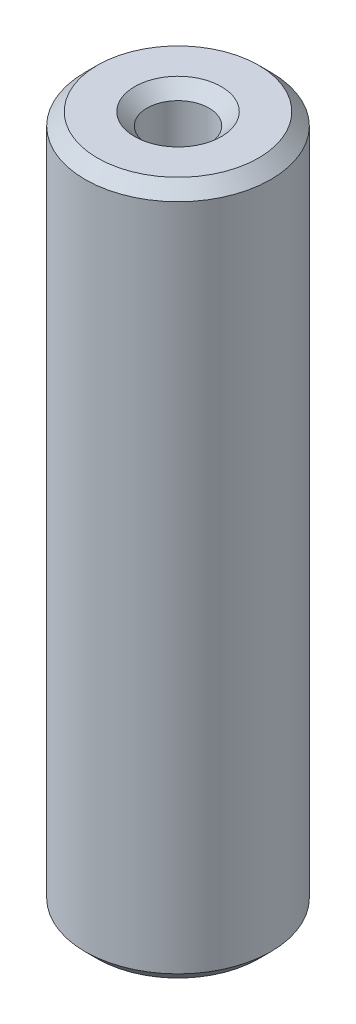
ISO-10303-21;
HEADER;
FILE_DESCRIPTION(('STEP AP214'),'2;1');
FILE_NAME('part.step','',(''),(''),'','','');
FILE_SCHEMA(('AUTOMOTIVE_DESIGN { 1 0 10303 214 1 1 1 1 }'));
ENDSEC;
DATA;
#1=APPLICATION_CONTEXT('core data for automotive mechanical design processes');
#2=APPLICATION_PROTOCOL_DEFINITION('international standard','automotive_design',2000,#1);
#3=PRODUCT_CONTEXT('',#1,'mechanical');
#4=PRODUCT('Part','Part','',(#3));
#5=PRODUCT_RELATED_PRODUCT_CATEGORY('part','',(#4));
#6=PRODUCT_DEFINITION_FORMATION('','',#4);
#7=PRODUCT_DEFINITION_CONTEXT('part definition',#1,'design');
#8=PRODUCT_DEFINITION('design','',#6,#7);
#9=PRODUCT_DEFINITION_SHAPE('','',#8);
#10=(LENGTH_UNIT() NAMED_UNIT(*) SI_UNIT(.MILLI.,.METRE.));
#11=(NAMED_UNIT(*) PLANE_ANGLE_UNIT() SI_UNIT($,.RADIAN.));
#12=(NAMED_UNIT(*) SI_UNIT($,.STERADIAN.) SOLID_ANGLE_UNIT());
#13=UNCERTAINTY_MEASURE_WITH_UNIT(LENGTH_MEASURE(1.E-05),#10,'distance_accuracy_value','');
#14=(GEOMETRIC_REPRESENTATION_CONTEXT(3) GLOBAL_UNCERTAINTY_ASSIGNED_CONTEXT((#13)) GLOBAL_UNIT_ASSIGNED_CONTEXT((#10,
#11,#12)) REPRESENTATION_CONTEXT('',''));
#15=CARTESIAN_POINT('',(0.,0.,0.));
#16=DIRECTION('',(0.,0.,1.));
#17=DIRECTION('',(1.,0.,0.));
#18=AXIS2_PLACEMENT_3D('',#15,#16,#17);
#19=CARTESIAN_POINT('',(0.,56.,0.));
#20=DIRECTION('',(0.,1.,0.));
#21=DIRECTION('',(0.,0.,1.));
#22=AXIS2_PLACEMENT_3D('',#19,#20,#21);
#23=PLANE('',#22);
#24=CARTESIAN_POINT('',(0.,56.,0.));
#25=DIRECTION('',(0.,1.,0.));
#26=DIRECTION('',(0.,0.,1.));
#27=AXIS2_PLACEMENT_3D('',#24,#25,#26);
#28=CIRCLE('',#27,3.5);
#29=CARTESIAN_POINT('',(0.,56.,3.5));
#30=VERTEX_POINT('',#29);
#31=EDGE_CURVE('E10',#30,#30,#28,.F.);
#32=ORIENTED_EDGE('',*,*,#31,.T.);
#33=EDGE_LOOP('',(#32));
#34=FACE_BOUND('',#33,.T.);
#35=CARTESIAN_POINT('',(0.,56.,0.));
#36=DIRECTION('',(0.,1.,0.));
#37=DIRECTION('',(0.,0.,1.));
#38=AXIS2_PLACEMENT_3D('',#35,#36,#37);
#39=CIRCLE('',#38,6.50000000000001);
#40=CARTESIAN_POINT('',(0.,56.,6.50000000000001));
#41=VERTEX_POINT('',#40);
#42=EDGE_CURVE('E35',#41,#41,#39,.T.);
#43=ORIENTED_EDGE('',*,*,#42,.T.);
#44=EDGE_LOOP('',(#43));
#45=FACE_BOUND('',#44,.T.);
#46=ADVANCED_FACE('F28',(#34,#45),#23,.T.);
#47=CARTESIAN_POINT('',(0.,0.,0.));
#48=DIRECTION('',(0.,1.,0.));
#49=DIRECTION('',(0.,0.,1.));
#50=AXIS2_PLACEMENT_3D('',#47,#48,#49);
#51=PLANE('',#50);
#52=CARTESIAN_POINT('',(0.,0.,0.));
#53=DIRECTION('',(0.,1.,0.));
#54=DIRECTION('',(0.,0.,1.));
#55=AXIS2_PLACEMENT_3D('',#52,#53,#54);
#56=CIRCLE('',#55,3.5);
#57=CARTESIAN_POINT('',(0.,0.,3.5));
#58=VERTEX_POINT('',#57);
#59=EDGE_CURVE('E54',#58,#58,#56,.T.);
#60=ORIENTED_EDGE('',*,*,#59,.T.);
#61=EDGE_LOOP('',(#60));
#62=FACE_BOUND('',#61,.T.);
#63=CARTESIAN_POINT('',(0.,0.,0.));
#64=DIRECTION('',(0.,1.,0.));
#65=DIRECTION('',(0.,0.,1.));
#66=AXIS2_PLACEMENT_3D('',#63,#64,#65);
#67=CIRCLE('',#66,6.49999999999999);
#68=CARTESIAN_POINT('',(0.,0.,6.49999999999999));
#69=VERTEX_POINT('',#68);
#70=EDGE_CURVE('E57',#69,#69,#67,.F.);
#71=ORIENTED_EDGE('',*,*,#70,.T.);
#72=EDGE_LOOP('',(#71));
#73=FACE_BOUND('',#72,.T.);
#74=ADVANCED_FACE('F61',(#62,#73),#51,.F.);
#75=CARTESIAN_POINT('',(0.,56.,0.));
#76=DIRECTION('',(0.,-1.,0.));
#77=DIRECTION('',(0.,0.,-1.));
#78=AXIS2_PLACEMENT_3D('',#75,#76,#77);
#79=CYLINDRICAL_SURFACE('',#78,7.5);
#80=CARTESIAN_POINT('',(0.,1.,0.));
#81=DIRECTION('',(0.,1.,0.));
#82=DIRECTION('',(0.,0.,1.));
#83=AXIS2_PLACEMENT_3D('',#80,#81,#82);
#84=CIRCLE('',#83,7.5);
#85=CARTESIAN_POINT('',(0.,1.,7.5));
#86=VERTEX_POINT('',#85);
#87=EDGE_CURVE('E39',#86,#86,#84,.T.);
#88=ORIENTED_EDGE('',*,*,#87,.T.);
#89=EDGE_LOOP('',(#88));
#90=FACE_BOUND('',#89,.T.);
#91=CARTESIAN_POINT('',(0.,55.,0.));
#92=DIRECTION('',(0.,1.,0.));
#93=DIRECTION('',(0.,0.,1.));
#94=AXIS2_PLACEMENT_3D('',#91,#92,#93);
#95=CIRCLE('',#94,7.5);
#96=CARTESIAN_POINT('',(0.,55.,7.5));
#97=VERTEX_POINT('',#96);
#98=EDGE_CURVE('E43',#97,#97,#95,.F.);
#99=ORIENTED_EDGE('',*,*,#98,.T.);
#100=EDGE_LOOP('',(#99));
#101=FACE_BOUND('',#100,.T.);
#102=ADVANCED_FACE('F71',(#90,#101),#79,.T.);
#103=CARTESIAN_POINT('',(0.,56.,0.));
#104=DIRECTION('',(0.,-1.,0.));
#105=DIRECTION('',(0.,0.,-1.));
#106=AXIS2_PLACEMENT_3D('',#103,#104,#105);
#107=CYLINDRICAL_SURFACE('',#106,2.5);
#108=CARTESIAN_POINT('',(0.,1.,0.));
#109=DIRECTION('',(0.,1.,0.));
#110=DIRECTION('',(0.,0.,1.));
#111=AXIS2_PLACEMENT_3D('',#108,#109,#110);
#112=CIRCLE('',#111,2.5);
#113=CARTESIAN_POINT('',(0.,1.,2.5));
#114=VERTEX_POINT('',#113);
#115=EDGE_CURVE('E48',#114,#114,#112,.F.);
#116=ORIENTED_EDGE('',*,*,#115,.T.);
#117=EDGE_LOOP('',(#116));
#118=FACE_BOUND('',#117,.T.);
#119=CARTESIAN_POINT('',(0.,55.,0.));
#120=DIRECTION('',(0.,1.,0.));
#121=DIRECTION('',(0.,0.,1.));
#122=AXIS2_PLACEMENT_3D('',#119,#120,#121);
#123=CIRCLE('',#122,2.5);
#124=CARTESIAN_POINT('',(0.,55.,2.5));
#125=VERTEX_POINT('',#124);
#126=EDGE_CURVE('E51',#125,#125,#123,.T.);
#127=ORIENTED_EDGE('',*,*,#126,.T.);
#128=EDGE_LOOP('',(#127));
#129=FACE_BOUND('',#128,.T.);
#130=ADVANCED_FACE('F74',(#118,#129),#107,.F.);
#131=CARTESIAN_POINT('',(0.,0.,0.));
#132=DIRECTION('',(0.,-1.,0.));
#133=DIRECTION('',(0.,0.,-1.));
#134=AXIS2_PLACEMENT_3D('',#131,#132,#133);
#135=CONICAL_SURFACE('',#134,3.5,0.785398163397446);
#136=ORIENTED_EDGE('',*,*,#115,.F.);
#137=EDGE_LOOP('',(#136));
#138=FACE_BOUND('',#137,.T.);
#139=ORIENTED_EDGE('',*,*,#59,.F.);
#140=EDGE_LOOP('',(#139));
#141=FACE_BOUND('',#140,.T.);
#142=ADVANCED_FACE('F67',(#138,#141),#135,.F.);
#143=CARTESIAN_POINT('',(0.,1.,0.));
#144=DIRECTION('',(0.,1.,0.));
#145=DIRECTION('',(0.,0.,1.));
#146=AXIS2_PLACEMENT_3D('',#143,#144,#145);
#147=CONICAL_SURFACE('',#146,7.5,0.785398163397451);
#148=ORIENTED_EDGE('',*,*,#70,.F.);
#149=EDGE_LOOP('',(#148));
#150=FACE_BOUND('',#149,.T.);
#151=ORIENTED_EDGE('',*,*,#87,.F.);
#152=EDGE_LOOP('',(#151));
#153=FACE_BOUND('',#152,.T.);
#154=ADVANCED_FACE('F63',(#150,#153),#147,.T.);
#155=CARTESIAN_POINT('',(0.,55.,0.));
#156=DIRECTION('',(0.,1.,0.));
#157=DIRECTION('',(0.,0.,1.));
#158=AXIS2_PLACEMENT_3D('',#155,#156,#157);
#159=CONICAL_SURFACE('',#158,2.5,0.785398163397449);
#160=ORIENTED_EDGE('',*,*,#31,.F.);
#161=EDGE_LOOP('',(#160));
#162=FACE_BOUND('',#161,.T.);
#163=ORIENTED_EDGE('',*,*,#126,.F.);
#164=EDGE_LOOP('',(#163));
#165=FACE_BOUND('',#164,.T.);
#166=ADVANCED_FACE('F66',(#162,#165),#159,.F.);
#167=CARTESIAN_POINT('',(0.,56.,0.));
#168=DIRECTION('',(0.,-1.,0.));
#169=DIRECTION('',(0.,0.,-1.));
#170=AXIS2_PLACEMENT_3D('',#167,#168,#169);
#171=CONICAL_SURFACE('',#170,6.50000000000001,0.785398163397445);
#172=ORIENTED_EDGE('',*,*,#98,.F.);
#173=EDGE_LOOP('',(#172));
#174=FACE_BOUND('',#173,.T.);
#175=ORIENTED_EDGE('',*,*,#42,.F.);
#176=EDGE_LOOP('',(#175));
#177=FACE_BOUND('',#176,.T.);
#178=ADVANCED_FACE('F30',(#174,#177),#171,.T.);
#179=CLOSED_SHELL('',(#46,#74,#102,#130,#142,#154,#166,#178));
#180=MANIFOLD_SOLID_BREP('B2',#179);
#181=ADVANCED_BREP_SHAPE_REPRESENTATION('',(#18,#180),#14);
#182=SHAPE_DEFINITION_REPRESENTATION(#9,#181);
ENDSEC;
END-ISO-10303-21;
